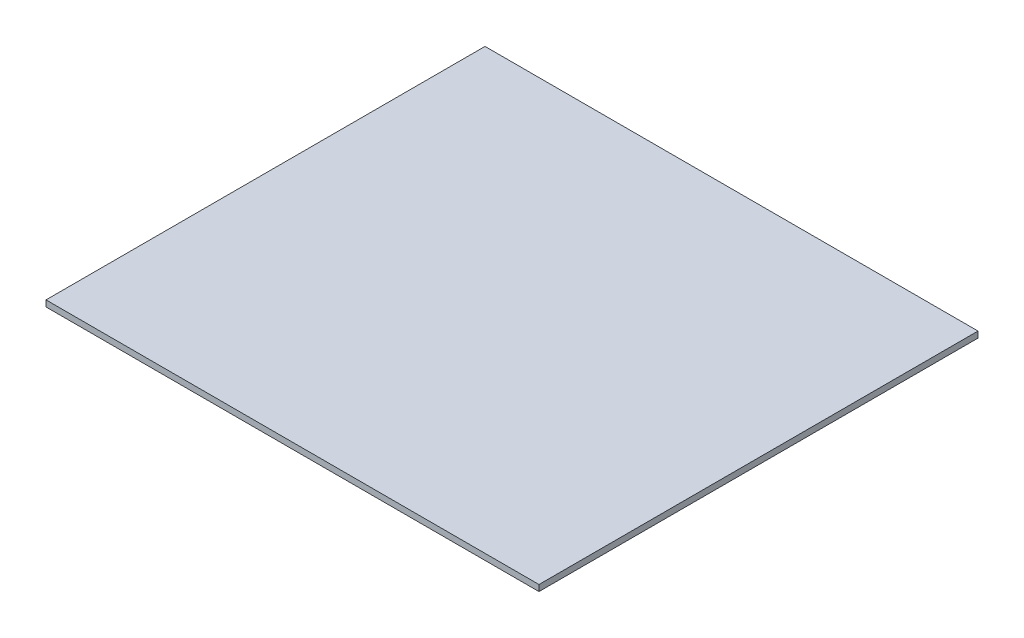
ISO-10303-21;
HEADER;
FILE_DESCRIPTION(('STEP AP214'),'2;1');
FILE_NAME('part.step','',(''),(''),'','','');
FILE_SCHEMA(('AUTOMOTIVE_DESIGN { 1 0 10303 214 1 1 1 1 }'));
ENDSEC;
DATA;
#1=APPLICATION_CONTEXT('core data for automotive mechanical design processes');
#2=APPLICATION_PROTOCOL_DEFINITION('international standard','automotive_design',2000,#1);
#3=PRODUCT_CONTEXT('',#1,'mechanical');
#4=PRODUCT('Part','Part','',(#3));
#5=PRODUCT_RELATED_PRODUCT_CATEGORY('part','',(#4));
#6=PRODUCT_DEFINITION_FORMATION('','',#4);
#7=PRODUCT_DEFINITION_CONTEXT('part definition',#1,'design');
#8=PRODUCT_DEFINITION('design','',#6,#7);
#9=PRODUCT_DEFINITION_SHAPE('','',#8);
#10=(LENGTH_UNIT() NAMED_UNIT(*) SI_UNIT(.MILLI.,.METRE.));
#11=(NAMED_UNIT(*) PLANE_ANGLE_UNIT() SI_UNIT($,.RADIAN.));
#12=(NAMED_UNIT(*) SI_UNIT($,.STERADIAN.) SOLID_ANGLE_UNIT());
#13=UNCERTAINTY_MEASURE_WITH_UNIT(LENGTH_MEASURE(1.E-05),#10,'distance_accuracy_value','');
#14=(GEOMETRIC_REPRESENTATION_CONTEXT(3) GLOBAL_UNCERTAINTY_ASSIGNED_CONTEXT((#13)) GLOBAL_UNIT_ASSIGNED_CONTEXT((#10,
#11,#12)) REPRESENTATION_CONTEXT('',''));
#15=CARTESIAN_POINT('',(0.,0.,0.));
#16=DIRECTION('',(0.,0.,1.));
#17=DIRECTION('',(1.,0.,0.));
#18=AXIS2_PLACEMENT_3D('',#15,#16,#17);
#19=CARTESIAN_POINT('',(64.175,1.6,-57.15));
#20=DIRECTION('',(-1.,0.,0.));
#21=DIRECTION('',(0.,0.,1.));
#22=AXIS2_PLACEMENT_3D('',#19,#20,#21);
#23=PLANE('',#22);
#24=DIRECTION('',(0.,0.,-1.));
#25=VECTOR('',#24,1.);
#26=CARTESIAN_POINT('',(64.175,0.,-57.15));
#27=LINE('',#26,#25);
#28=CARTESIAN_POINT('',(64.175,0.,57.15));
#29=VERTEX_POINT('',#28);
#30=CARTESIAN_POINT('',(64.175,0.,-57.15));
#31=VERTEX_POINT('',#30);
#32=EDGE_CURVE('E111',#29,#31,#27,.T.);
#33=ORIENTED_EDGE('',*,*,#32,.T.);
#34=DIRECTION('',(0.,-1.,0.));
#35=VECTOR('',#34,1.);
#36=CARTESIAN_POINT('',(64.175,1.6,-57.15));
#37=LINE('',#36,#35);
#38=CARTESIAN_POINT('',(64.175,1.6,-57.15));
#39=VERTEX_POINT('',#38);
#40=EDGE_CURVE('E11',#39,#31,#37,.T.);
#41=ORIENTED_EDGE('',*,*,#40,.F.);
#42=DIRECTION('',(0.,0.,-1.));
#43=VECTOR('',#42,1.);
#44=CARTESIAN_POINT('',(64.175,1.6,-57.15));
#45=LINE('',#44,#43);
#46=CARTESIAN_POINT('',(64.175,1.6,57.15));
#47=VERTEX_POINT('',#46);
#48=EDGE_CURVE('E95',#47,#39,#45,.T.);
#49=ORIENTED_EDGE('',*,*,#48,.F.);
#50=DIRECTION('',(0.,-1.,0.));
#51=VECTOR('',#50,1.);
#52=CARTESIAN_POINT('',(64.175,1.6,57.15));
#53=LINE('',#52,#51);
#54=EDGE_CURVE('E107',#47,#29,#53,.T.);
#55=ORIENTED_EDGE('',*,*,#54,.T.);
#56=EDGE_LOOP('',(#33,#41,#49,#55));
#57=FACE_BOUND('',#56,.T.);
#58=ADVANCED_FACE('F43',(#57),#23,.F.);
#59=CARTESIAN_POINT('',(-64.175,1.6,-57.15));
#60=DIRECTION('',(0.,0.,1.));
#61=DIRECTION('',(1.,0.,0.));
#62=AXIS2_PLACEMENT_3D('',#59,#60,#61);
#63=PLANE('',#62);
#64=DIRECTION('',(-1.,0.,0.));
#65=VECTOR('',#64,1.);
#66=CARTESIAN_POINT('',(-64.175,0.,-57.15));
#67=LINE('',#66,#65);
#68=CARTESIAN_POINT('',(-64.175,0.,-57.15));
#69=VERTEX_POINT('',#68);
#70=EDGE_CURVE('E100',#31,#69,#67,.T.);
#71=ORIENTED_EDGE('',*,*,#70,.T.);
#72=DIRECTION('',(0.,-1.,0.));
#73=VECTOR('',#72,1.);
#74=CARTESIAN_POINT('',(-64.175,1.6,-57.15));
#75=LINE('',#74,#73);
#76=CARTESIAN_POINT('',(-64.175,1.6,-57.15));
#77=VERTEX_POINT('',#76);
#78=EDGE_CURVE('E52',#77,#69,#75,.T.);
#79=ORIENTED_EDGE('',*,*,#78,.F.);
#80=DIRECTION('',(-1.,0.,0.));
#81=VECTOR('',#80,1.);
#82=CARTESIAN_POINT('',(-64.175,1.6,-57.15));
#83=LINE('',#82,#81);
#84=EDGE_CURVE('E90',#39,#77,#83,.T.);
#85=ORIENTED_EDGE('',*,*,#84,.F.);
#86=ORIENTED_EDGE('',*,*,#40,.T.);
#87=EDGE_LOOP('',(#71,#79,#85,#86));
#88=FACE_BOUND('',#87,.T.);
#89=ADVANCED_FACE('F99',(#88),#63,.F.);
#90=CARTESIAN_POINT('',(-64.175,1.6,-57.15));
#91=DIRECTION('',(1.,0.,0.));
#92=DIRECTION('',(0.,0.,-1.));
#93=AXIS2_PLACEMENT_3D('',#90,#91,#92);
#94=PLANE('',#93);
#95=DIRECTION('',(0.,0.,1.));
#96=VECTOR('',#95,1.);
#97=CARTESIAN_POINT('',(-64.175,0.,-57.15));
#98=LINE('',#97,#96);
#99=CARTESIAN_POINT('',(-64.175,0.,57.15));
#100=VERTEX_POINT('',#99);
#101=EDGE_CURVE('E77',#69,#100,#98,.T.);
#102=ORIENTED_EDGE('',*,*,#101,.T.);
#103=DIRECTION('',(0.,-1.,0.));
#104=VECTOR('',#103,1.);
#105=CARTESIAN_POINT('',(-64.175,1.6,57.15));
#106=LINE('',#105,#104);
#107=CARTESIAN_POINT('',(-64.175,1.6,57.15));
#108=VERTEX_POINT('',#107);
#109=EDGE_CURVE('E102',#108,#100,#106,.T.);
#110=ORIENTED_EDGE('',*,*,#109,.F.);
#111=DIRECTION('',(0.,0.,1.));
#112=VECTOR('',#111,1.);
#113=CARTESIAN_POINT('',(-64.175,1.6,-57.15));
#114=LINE('',#113,#112);
#115=EDGE_CURVE('E93',#77,#108,#114,.T.);
#116=ORIENTED_EDGE('',*,*,#115,.F.);
#117=ORIENTED_EDGE('',*,*,#78,.T.);
#118=EDGE_LOOP('',(#102,#110,#116,#117));
#119=FACE_BOUND('',#118,.T.);
#120=ADVANCED_FACE('F103',(#119),#94,.F.);
#121=CARTESIAN_POINT('',(-64.175,1.6,57.15));
#122=DIRECTION('',(0.,0.,-1.));
#123=DIRECTION('',(-1.,0.,0.));
#124=AXIS2_PLACEMENT_3D('',#121,#122,#123);
#125=PLANE('',#124);
#126=DIRECTION('',(1.,0.,0.));
#127=VECTOR('',#126,1.);
#128=CARTESIAN_POINT('',(-64.175,0.,57.15));
#129=LINE('',#128,#127);
#130=EDGE_CURVE('E83',#100,#29,#129,.T.);
#131=ORIENTED_EDGE('',*,*,#130,.T.);
#132=ORIENTED_EDGE('',*,*,#54,.F.);
#133=DIRECTION('',(1.,0.,0.));
#134=VECTOR('',#133,1.);
#135=CARTESIAN_POINT('',(-64.175,1.6,57.15));
#136=LINE('',#135,#134);
#137=EDGE_CURVE('E60',#108,#47,#136,.T.);
#138=ORIENTED_EDGE('',*,*,#137,.F.);
#139=ORIENTED_EDGE('',*,*,#109,.T.);
#140=EDGE_LOOP('',(#131,#132,#138,#139));
#141=FACE_BOUND('',#140,.T.);
#142=ADVANCED_FACE('F124',(#141),#125,.F.);
#143=CARTESIAN_POINT('',(0.,1.6,0.));
#144=DIRECTION('',(0.,1.,0.));
#145=DIRECTION('',(0.,0.,1.));
#146=AXIS2_PLACEMENT_3D('',#143,#144,#145);
#147=PLANE('',#146);
#148=ORIENTED_EDGE('',*,*,#48,.T.);
#149=ORIENTED_EDGE('',*,*,#84,.T.);
#150=ORIENTED_EDGE('',*,*,#115,.T.);
#151=ORIENTED_EDGE('',*,*,#137,.T.);
#152=EDGE_LOOP('',(#148,#149,#150,#151));
#153=FACE_BOUND('',#152,.T.);
#154=ADVANCED_FACE('F91',(#153),#147,.T.);
#155=CARTESIAN_POINT('',(0.,0.,0.));
#156=DIRECTION('',(0.,1.,0.));
#157=DIRECTION('',(0.,0.,1.));
#158=AXIS2_PLACEMENT_3D('',#155,#156,#157);
#159=PLANE('',#158);
#160=ORIENTED_EDGE('',*,*,#32,.F.);
#161=ORIENTED_EDGE('',*,*,#130,.F.);
#162=ORIENTED_EDGE('',*,*,#101,.F.);
#163=ORIENTED_EDGE('',*,*,#70,.F.);
#164=EDGE_LOOP('',(#160,#161,#162,#163));
#165=FACE_BOUND('',#164,.T.);
#166=ADVANCED_FACE('F127',(#165),#159,.F.);
#167=CLOSED_SHELL('',(#58,#89,#120,#142,#154,#166));
#168=MANIFOLD_SOLID_BREP('B2',#167);
#169=ADVANCED_BREP_SHAPE_REPRESENTATION('',(#18,#168),#14);
#170=SHAPE_DEFINITION_REPRESENTATION(#9,#169);
ENDSEC;
END-ISO-10303-21;
